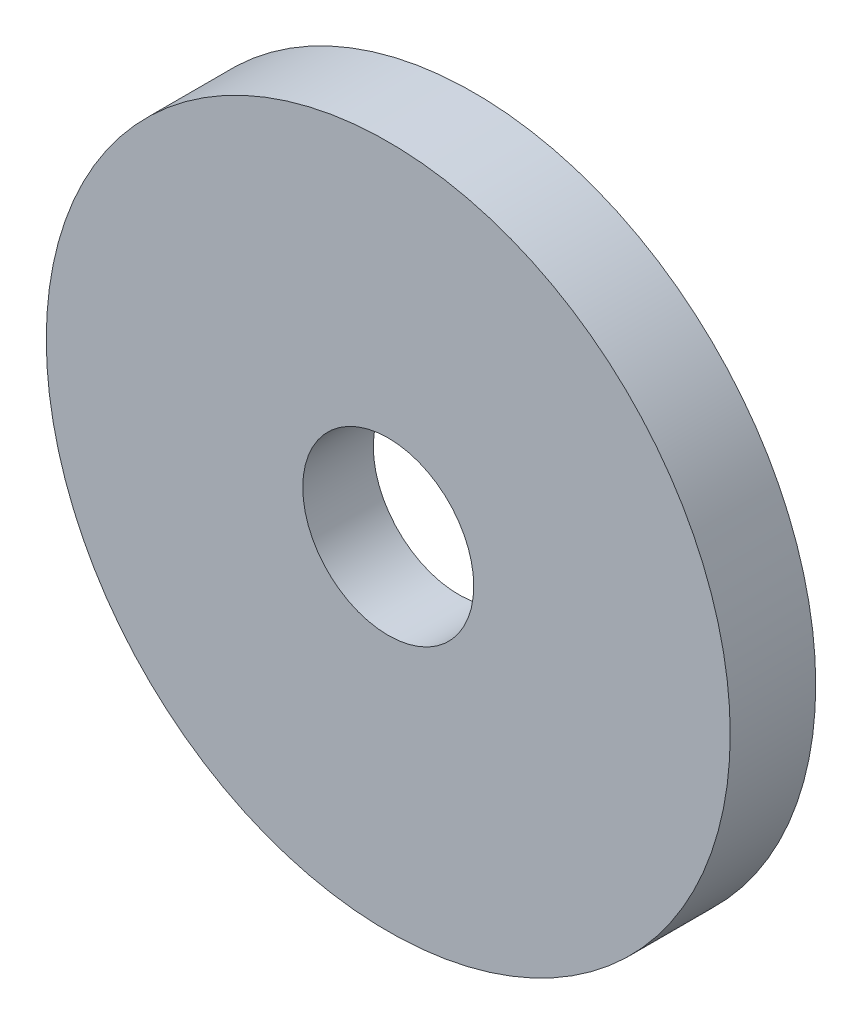
ISO-10303-21;
HEADER;
FILE_DESCRIPTION(('STEP AP214'),'2;1');
FILE_NAME('part.step','',(''),(''),'','','');
FILE_SCHEMA(('AUTOMOTIVE_DESIGN { 1 0 10303 214 1 1 1 1 }'));
ENDSEC;
DATA;
#1=APPLICATION_CONTEXT('core data for automotive mechanical design processes');
#2=APPLICATION_PROTOCOL_DEFINITION('international standard','automotive_design',2000,#1);
#3=PRODUCT_CONTEXT('',#1,'mechanical');
#4=PRODUCT('Part','Part','',(#3));
#5=PRODUCT_RELATED_PRODUCT_CATEGORY('part','',(#4));
#6=PRODUCT_DEFINITION_FORMATION('','',#4);
#7=PRODUCT_DEFINITION_CONTEXT('part definition',#1,'design');
#8=PRODUCT_DEFINITION('design','',#6,#7);
#9=PRODUCT_DEFINITION_SHAPE('','',#8);
#10=(LENGTH_UNIT() NAMED_UNIT(*) SI_UNIT(.MILLI.,.METRE.));
#11=(NAMED_UNIT(*) PLANE_ANGLE_UNIT() SI_UNIT($,.RADIAN.));
#12=(NAMED_UNIT(*) SI_UNIT($,.STERADIAN.) SOLID_ANGLE_UNIT());
#13=UNCERTAINTY_MEASURE_WITH_UNIT(LENGTH_MEASURE(1.E-05),#10,'distance_accuracy_value','');
#14=(GEOMETRIC_REPRESENTATION_CONTEXT(3) GLOBAL_UNCERTAINTY_ASSIGNED_CONTEXT((#13)) GLOBAL_UNIT_ASSIGNED_CONTEXT((#10,
#11,#12)) REPRESENTATION_CONTEXT('',''));
#15=CARTESIAN_POINT('',(0.,0.,0.));
#16=DIRECTION('',(0.,0.,1.));
#17=DIRECTION('',(1.,0.,0.));
#18=AXIS2_PLACEMENT_3D('',#15,#16,#17);
#19=CARTESIAN_POINT('',(0.,0.,0.25));
#20=DIRECTION('',(0.,0.,1.));
#21=DIRECTION('',(1.,0.,0.));
#22=AXIS2_PLACEMENT_3D('',#19,#20,#21);
#23=PLANE('',#22);
#24=CARTESIAN_POINT('',(0.,0.,0.25));
#25=DIRECTION('',(0.,0.,1.));
#26=DIRECTION('',(1.,0.,0.));
#27=AXIS2_PLACEMENT_3D('',#24,#25,#26);
#28=CIRCLE('',#27,1.);
#29=CARTESIAN_POINT('',(1.,0.,0.25));
#30=VERTEX_POINT('',#29);
#31=EDGE_CURVE('E10',#30,#30,#28,.T.);
#32=ORIENTED_EDGE('',*,*,#31,.T.);
#33=EDGE_LOOP('',(#32));
#34=FACE_BOUND('',#33,.T.);
#35=CARTESIAN_POINT('',(0.,0.,0.25));
#36=DIRECTION('',(0.,0.,1.));
#37=DIRECTION('',(1.,0.,0.));
#38=AXIS2_PLACEMENT_3D('',#35,#36,#37);
#39=CIRCLE('',#38,0.25);
#40=CARTESIAN_POINT('',(0.25,0.,0.25));
#41=VERTEX_POINT('',#40);
#42=EDGE_CURVE('E47',#41,#41,#39,.T.);
#43=ORIENTED_EDGE('',*,*,#42,.F.);
#44=EDGE_LOOP('',(#43));
#45=FACE_BOUND('',#44,.T.);
#46=ADVANCED_FACE('F34',(#34,#45),#23,.T.);
#47=CARTESIAN_POINT('',(0.,0.,0.));
#48=DIRECTION('',(0.,0.,1.));
#49=DIRECTION('',(1.,0.,0.));
#50=AXIS2_PLACEMENT_3D('',#47,#48,#49);
#51=PLANE('',#50);
#52=CARTESIAN_POINT('',(0.,0.,0.));
#53=DIRECTION('',(0.,0.,-1.));
#54=DIRECTION('',(-1.,0.,0.));
#55=AXIS2_PLACEMENT_3D('',#52,#53,#54);
#56=CIRCLE('',#55,0.75);
#57=CARTESIAN_POINT('',(-0.75,0.,0.));
#58=VERTEX_POINT('',#57);
#59=EDGE_CURVE('E51',#58,#58,#56,.T.);
#60=ORIENTED_EDGE('',*,*,#59,.F.);
#61=EDGE_LOOP('',(#60));
#62=FACE_BOUND('',#61,.T.);
#63=CARTESIAN_POINT('',(0.,0.,0.));
#64=DIRECTION('',(0.,0.,1.));
#65=DIRECTION('',(1.,0.,0.));
#66=AXIS2_PLACEMENT_3D('',#63,#64,#65);
#67=CIRCLE('',#66,1.);
#68=CARTESIAN_POINT('',(1.,0.,0.));
#69=VERTEX_POINT('',#68);
#70=EDGE_CURVE('E42',#69,#69,#67,.T.);
#71=ORIENTED_EDGE('',*,*,#70,.F.);
#72=EDGE_LOOP('',(#71));
#73=FACE_BOUND('',#72,.T.);
#74=ADVANCED_FACE('F67',(#62,#73),#51,.F.);
#75=CARTESIAN_POINT('',(0.,0.,0.25));
#76=DIRECTION('',(0.,0.,-1.));
#77=DIRECTION('',(-1.,0.,0.));
#78=AXIS2_PLACEMENT_3D('',#75,#76,#77);
#79=CYLINDRICAL_SURFACE('',#78,1.);
#80=ORIENTED_EDGE('',*,*,#31,.F.);
#81=EDGE_LOOP('',(#80));
#82=FACE_BOUND('',#81,.T.);
#83=ORIENTED_EDGE('',*,*,#70,.T.);
#84=EDGE_LOOP('',(#83));
#85=FACE_BOUND('',#84,.T.);
#86=ADVANCED_FACE('F36',(#82,#85),#79,.T.);
#87=CARTESIAN_POINT('',(0.,0.,0.25));
#88=DIRECTION('',(0.,0.,-1.));
#89=DIRECTION('',(-1.,0.,0.));
#90=AXIS2_PLACEMENT_3D('',#87,#88,#89);
#91=CYLINDRICAL_SURFACE('',#90,0.25);
#92=CARTESIAN_POINT('',(0.,0.,0.0437443317629604));
#93=DIRECTION('',(0.,0.,-1.));
#94=DIRECTION('',(-1.,0.,0.));
#95=AXIS2_PLACEMENT_3D('',#92,#93,#94);
#96=CIRCLE('',#95,0.25);
#97=CARTESIAN_POINT('',(-0.25,0.,0.0437443317629604));
#98=VERTEX_POINT('',#97);
#99=EDGE_CURVE('E38',#98,#98,#96,.F.);
#100=ORIENTED_EDGE('',*,*,#99,.F.);
#101=EDGE_LOOP('',(#100));
#102=FACE_BOUND('',#101,.T.);
#103=ORIENTED_EDGE('',*,*,#42,.T.);
#104=EDGE_LOOP('',(#103));
#105=FACE_BOUND('',#104,.T.);
#106=ADVANCED_FACE('F60',(#102,#105),#91,.F.);
#107=CARTESIAN_POINT('',(0.,0.,0.));
#108=DIRECTION('',(0.,0.,-1.));
#109=DIRECTION('',(-1.,0.,0.));
#110=AXIS2_PLACEMENT_3D('',#107,#108,#109);
#111=CONICAL_SURFACE('',#110,0.75,1.48352986419518);
#112=CARTESIAN_POINT('',(-0.25,0.,0.0437443317629604));
#113=CARTESIAN_POINT('',(-0.255208333333333,0.,0.0432886616404296));
#114=CARTESIAN_POINT('',(-0.260416666666667,0.,0.0428329915178988));
#115=CARTESIAN_POINT('',(-0.270833333333333,0.,0.0419216512728371));
#116=CARTESIAN_POINT('',(-0.276041666666667,0.,0.0414659811503062));
#117=CARTESIAN_POINT('',(-0.286458333333333,0.,0.0405546409052446));
#118=CARTESIAN_POINT('',(-0.291666666666667,0.,0.0400989707827137));
#119=CARTESIAN_POINT('',(-0.302083333333333,0.,0.039187630537652));
#120=CARTESIAN_POINT('',(-0.307291666666667,0.,0.0387319604151212));
#121=CARTESIAN_POINT('',(-0.317708333333333,0.,0.0378206201700595));
#122=CARTESIAN_POINT('',(-0.322916666666667,0.,0.0373649500475287));
#123=CARTESIAN_POINT('',(-0.333333333333333,0.,0.036453609802467));
#124=CARTESIAN_POINT('',(-0.338541666666667,0.,0.0359979396799362));
#125=CARTESIAN_POINT('',(-0.348958333333333,0.,0.0350865994348745));
#126=CARTESIAN_POINT('',(-0.354166666666667,0.,0.0346309293123437));
#127=CARTESIAN_POINT('',(-0.364583333333333,0.,0.033719589067282));
#128=CARTESIAN_POINT('',(-0.369791666666667,0.,0.0332639189447512));
#129=CARTESIAN_POINT('',(-0.380208333333333,0.,0.0323525786996895));
#130=CARTESIAN_POINT('',(-0.385416666666667,0.,0.0318969085771586));
#131=CARTESIAN_POINT('',(-0.395833333333333,0.,0.030985568332097));
#132=CARTESIAN_POINT('',(-0.401041666666667,0.,0.0305298982095661));
#133=CARTESIAN_POINT('',(-0.411458333333333,0.,0.0296185579645045));
#134=CARTESIAN_POINT('',(-0.416666666666667,0.,0.0291628878419736));
#135=CARTESIAN_POINT('',(-0.427083333333333,0.,0.0282515475969119));
#136=CARTESIAN_POINT('',(-0.432291666666667,0.,0.0277958774743811));
#137=CARTESIAN_POINT('',(-0.442708333333333,0.,0.0268845372293194));
#138=CARTESIAN_POINT('',(-0.447916666666667,0.,0.0264288671067886));
#139=CARTESIAN_POINT('',(-0.458333333333333,0.,0.0255175268617269));
#140=CARTESIAN_POINT('',(-0.463541666666667,0.,0.0250618567391961));
#141=CARTESIAN_POINT('',(-0.473958333333333,0.,0.0241505164941344));
#142=CARTESIAN_POINT('',(-0.479166666666667,0.,0.0236948463716036));
#143=CARTESIAN_POINT('',(-0.489583333333333,0.,0.0227835061265419));
#144=CARTESIAN_POINT('',(-0.494791666666667,0.,0.022327836004011));
#145=CARTESIAN_POINT('',(-0.505208333333333,0.,0.0214164957589494));
#146=CARTESIAN_POINT('',(-0.510416666666667,0.,0.0209608256364185));
#147=CARTESIAN_POINT('',(-0.520833333333333,0.,0.0200494853913569));
#148=CARTESIAN_POINT('',(-0.526041666666667,0.,0.019593815268826));
#149=CARTESIAN_POINT('',(-0.536458333333333,0.,0.0186824750237643));
#150=CARTESIAN_POINT('',(-0.541666666666667,0.,0.0182268049012335));
#151=CARTESIAN_POINT('',(-0.552083333333333,0.,0.0173154646561718));
#152=CARTESIAN_POINT('',(-0.557291666666667,0.,0.016859794533641));
#153=CARTESIAN_POINT('',(-0.567708333333333,0.,0.0159484542885793));
#154=CARTESIAN_POINT('',(-0.572916666666667,0.,0.0154927841660485));
#155=CARTESIAN_POINT('',(-0.583333333333333,0.,0.0145814439209868));
#156=CARTESIAN_POINT('',(-0.588541666666667,0.,0.014125773798456));
#157=CARTESIAN_POINT('',(-0.598958333333333,0.,0.0132144335533943));
#158=CARTESIAN_POINT('',(-0.604166666666667,0.,0.0127587634308635));
#159=CARTESIAN_POINT('',(-0.614583333333333,0.,0.0118474231858018));
#160=CARTESIAN_POINT('',(-0.619791666666667,0.,0.0113917530632709));
#161=CARTESIAN_POINT('',(-0.630208333333333,0.,0.0104804128182093));
#162=CARTESIAN_POINT('',(-0.635416666666667,0.,0.0100247426956784));
#163=CARTESIAN_POINT('',(-0.645833333333333,0.,0.00911340245061675));
#164=CARTESIAN_POINT('',(-0.651041666666667,0.,0.00865773232808592));
#165=CARTESIAN_POINT('',(-0.661458333333333,0.,0.00774639208302424));
#166=CARTESIAN_POINT('',(-0.666666666666667,0.,0.0072907219604934));
#167=CARTESIAN_POINT('',(-0.677083333333333,0.,0.00637938171543173));
#168=CARTESIAN_POINT('',(-0.682291666666667,0.,0.00592371159290089));
#169=CARTESIAN_POINT('',(-0.692708333333333,0.,0.00501237134783922));
#170=CARTESIAN_POINT('',(-0.697916666666667,0.,0.00455670122530838));
#171=CARTESIAN_POINT('',(-0.708333333333333,0.,0.0036453609802467));
#172=CARTESIAN_POINT('',(-0.713541666666667,0.,0.00318969085771586));
#173=CARTESIAN_POINT('',(-0.723958333333333,0.,0.00227835061265419));
#174=CARTESIAN_POINT('',(-0.729166666666667,0.,0.00182268049012335));
#175=CARTESIAN_POINT('',(-0.739583333333333,0.,0.000911340245061679));
#176=CARTESIAN_POINT('',(-0.744791666666667,0.,0.000455670122530842));
#177=CARTESIAN_POINT('',(-0.75,0.,0.));
#178=B_SPLINE_CURVE_WITH_KNOTS('',3,(#112,#113,#114,#115,#116,#117,#118,#119,#120,#121,#122,
#123,#124,#125,#126,#127,#128,#129,#130,#131,#132,#133,#134,#135,#136,#137,#138,#139,#140,#141,
#142,#143,#144,#145,#146,#147,#148,#149,#150,#151,#152,#153,#154,#155,#156,#157,#158,#159,#160,
#161,#162,#163,#164,#165,#166,#167,#168,#169,#170,#171,#172,#173,#174,#175,#176,#177),
.UNSPECIFIED.,.F.,.F.,(4,2,2,2,2,2,2,2,2,2,2,2,2,2,2,2,2,2,2,2,2,2,2,2,2,2,2,2,2,2,2,2,4),(0.,
0.0156846849616148,0.0313693699232295,0.0470540548848444,0.0627387398464592,0.078423424808074,
0.0941081097696888,0.109792794731304,0.125477479692918,0.141162164654533,0.156846849616148,
0.172531534577763,0.188216219539378,0.203900904500992,0.219585589462607,0.235270274424222,
0.250954959385837,0.266639644347452,0.282324329309066,0.298009014270681,0.313693699232296,
0.329378384193911,0.345063069155526,0.36074775411714,0.376432439078755,0.39211712404037,
0.407801809001985,0.4234864939636,0.439171178925214,0.454855863886829,0.470540548848444,
0.486225233810059,0.501909918771673),.UNSPECIFIED.);
#179=EDGE_CURVE('BSEAM58',#98,#58,#178,.T.);
#180=ORIENTED_EDGE('',*,*,#99,.T.);
#181=ORIENTED_EDGE('',*,*,#59,.T.);
#182=ORIENTED_EDGE('',*,*,#179,.T.);
#183=ORIENTED_EDGE('',*,*,#179,.F.);
#184=EDGE_LOOP('',(#180,#182,#181,#183));
#185=FACE_BOUND('',#184,.T.);
#186=ADVANCED_FACE('F58',(#185),#111,.F.);
#187=CLOSED_SHELL('',(#46,#74,#86,#106,#186));
#188=MANIFOLD_SOLID_BREP('B2',#187);
#189=ADVANCED_BREP_SHAPE_REPRESENTATION('',(#18,#188),#14);
#190=SHAPE_DEFINITION_REPRESENTATION(#9,#189);
ENDSEC;
END-ISO-10303-21;
